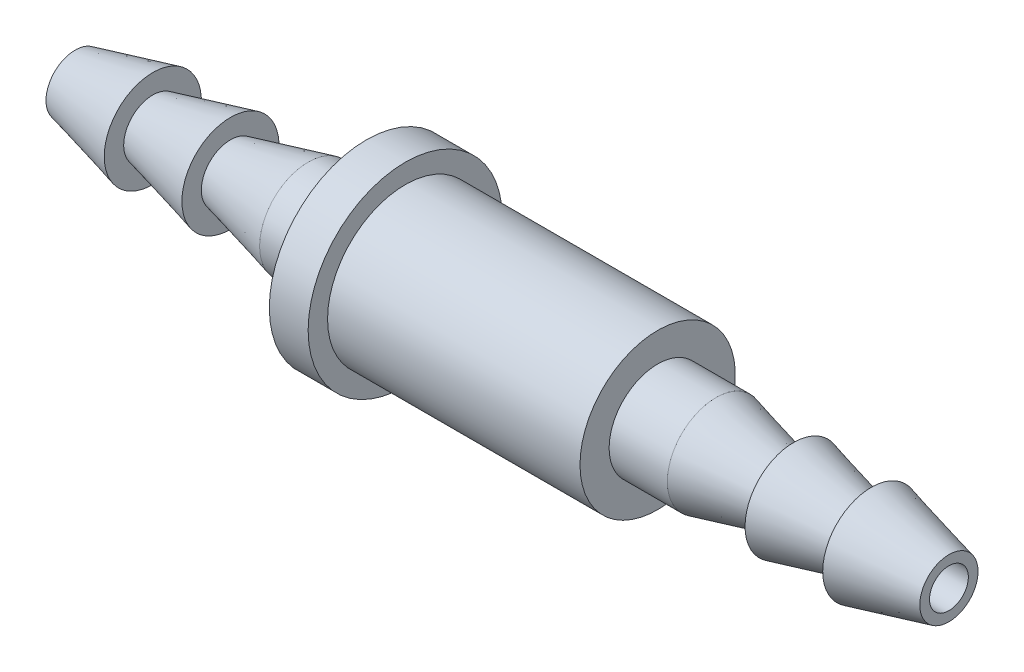
ISO-10303-21;
HEADER;
FILE_DESCRIPTION(('STEP AP214'),'2;1');
FILE_NAME('part.step','',(''),(''),'','','');
FILE_SCHEMA(('AUTOMOTIVE_DESIGN { 1 0 10303 214 1 1 1 1 }'));
ENDSEC;
DATA;
#1=APPLICATION_CONTEXT('core data for automotive mechanical design processes');
#2=APPLICATION_PROTOCOL_DEFINITION('international standard','automotive_design',2000,#1);
#3=PRODUCT_CONTEXT('',#1,'mechanical');
#4=PRODUCT('Part','Part','',(#3));
#5=PRODUCT_RELATED_PRODUCT_CATEGORY('part','',(#4));
#6=PRODUCT_DEFINITION_FORMATION('','',#4);
#7=PRODUCT_DEFINITION_CONTEXT('part definition',#1,'design');
#8=PRODUCT_DEFINITION('design','',#6,#7);
#9=PRODUCT_DEFINITION_SHAPE('','',#8);
#10=(LENGTH_UNIT() NAMED_UNIT(*) SI_UNIT(.MILLI.,.METRE.));
#11=(NAMED_UNIT(*) PLANE_ANGLE_UNIT() SI_UNIT($,.RADIAN.));
#12=(NAMED_UNIT(*) SI_UNIT($,.STERADIAN.) SOLID_ANGLE_UNIT());
#13=UNCERTAINTY_MEASURE_WITH_UNIT(LENGTH_MEASURE(1.E-05),#10,'distance_accuracy_value','');
#14=(GEOMETRIC_REPRESENTATION_CONTEXT(3) GLOBAL_UNCERTAINTY_ASSIGNED_CONTEXT((#13)) GLOBAL_UNIT_ASSIGNED_CONTEXT((#10,
#11,#12)) REPRESENTATION_CONTEXT('',''));
#15=CARTESIAN_POINT('',(0.,0.,0.));
#16=DIRECTION('',(0.,0.,1.));
#17=DIRECTION('',(1.,0.,0.));
#18=AXIS2_PLACEMENT_3D('',#15,#16,#17);
#19=CARTESIAN_POINT('',(0.,0.,0.));
#20=DIRECTION('',(-1.,0.,0.));
#21=DIRECTION('',(0.,0.,1.));
#22=AXIS2_PLACEMENT_3D('',#19,#20,#21);
#23=CONICAL_SURFACE('',#22,1.5,0.244978663126864);
#24=CARTESIAN_POINT('',(-4.,0.,0.));
#25=DIRECTION('',(-1.,0.,0.));
#26=DIRECTION('',(0.,0.,1.));
#27=AXIS2_PLACEMENT_3D('',#24,#25,#26);
#28=CIRCLE('',#27,2.5);
#29=CARTESIAN_POINT('',(-4.,0.,2.5));
#30=VERTEX_POINT('',#29);
#31=EDGE_CURVE('E10',#30,#30,#28,.T.);
#32=ORIENTED_EDGE('',*,*,#31,.F.);
#33=EDGE_LOOP('',(#32));
#34=FACE_BOUND('',#33,.T.);
#35=CARTESIAN_POINT('',(0.,0.,0.));
#36=DIRECTION('',(-1.,0.,0.));
#37=DIRECTION('',(0.,0.,1.));
#38=AXIS2_PLACEMENT_3D('',#35,#36,#37);
#39=CIRCLE('',#38,1.5);
#40=CARTESIAN_POINT('',(0.,0.,1.5));
#41=VERTEX_POINT('',#40);
#42=EDGE_CURVE('E92',#41,#41,#39,.T.);
#43=ORIENTED_EDGE('',*,*,#42,.T.);
#44=EDGE_LOOP('',(#43));
#45=FACE_BOUND('',#44,.T.);
#46=ADVANCED_FACE('F34',(#34,#45),#23,.T.);
#47=CARTESIAN_POINT('',(-4.,2.5,0.));
#48=DIRECTION('',(1.,0.,0.));
#49=DIRECTION('',(0.,0.,-1.));
#50=AXIS2_PLACEMENT_3D('',#47,#48,#49);
#51=PLANE('',#50);
#52=CARTESIAN_POINT('',(-4.,0.,0.));
#53=DIRECTION('',(-1.,0.,0.));
#54=DIRECTION('',(0.,0.,1.));
#55=AXIS2_PLACEMENT_3D('',#52,#53,#54);
#56=CIRCLE('',#55,1.5);
#57=CARTESIAN_POINT('',(-4.,0.,1.5));
#58=VERTEX_POINT('',#57);
#59=EDGE_CURVE('E40',#58,#58,#56,.T.);
#60=ORIENTED_EDGE('',*,*,#59,.F.);
#61=EDGE_LOOP('',(#60));
#62=FACE_BOUND('',#61,.T.);
#63=ORIENTED_EDGE('',*,*,#31,.T.);
#64=EDGE_LOOP('',(#63));
#65=FACE_BOUND('',#64,.T.);
#66=ADVANCED_FACE('F203',(#62,#65),#51,.F.);
#67=CARTESIAN_POINT('',(-4.,0.,0.));
#68=DIRECTION('',(-1.,0.,0.));
#69=DIRECTION('',(0.,0.,1.));
#70=AXIS2_PLACEMENT_3D('',#67,#68,#69);
#71=CONICAL_SURFACE('',#70,1.5,0.244978663126864);
#72=CARTESIAN_POINT('',(-8.00000000000001,0.,0.));
#73=DIRECTION('',(-1.,0.,0.));
#74=DIRECTION('',(0.,0.,1.));
#75=AXIS2_PLACEMENT_3D('',#72,#73,#74);
#76=CIRCLE('',#75,2.5);
#77=CARTESIAN_POINT('',(-8.00000000000001,0.,2.5));
#78=VERTEX_POINT('',#77);
#79=EDGE_CURVE('E44',#78,#78,#76,.T.);
#80=ORIENTED_EDGE('',*,*,#79,.F.);
#81=EDGE_LOOP('',(#80));
#82=FACE_BOUND('',#81,.T.);
#83=ORIENTED_EDGE('',*,*,#59,.T.);
#84=EDGE_LOOP('',(#83));
#85=FACE_BOUND('',#84,.T.);
#86=ADVANCED_FACE('F198',(#82,#85),#71,.T.);
#87=CARTESIAN_POINT('',(-8.,2.5,0.));
#88=DIRECTION('',(1.,0.,0.));
#89=DIRECTION('',(0.,0.,-1.));
#90=AXIS2_PLACEMENT_3D('',#87,#88,#89);
#91=PLANE('',#90);
#92=CARTESIAN_POINT('',(-8.00000000000001,0.,0.));
#93=DIRECTION('',(-1.,0.,0.));
#94=DIRECTION('',(0.,0.,1.));
#95=AXIS2_PLACEMENT_3D('',#92,#93,#94);
#96=CIRCLE('',#95,1.5);
#97=CARTESIAN_POINT('',(-8.00000000000001,0.,1.5));
#98=VERTEX_POINT('',#97);
#99=EDGE_CURVE('E48',#98,#98,#96,.T.);
#100=ORIENTED_EDGE('',*,*,#99,.F.);
#101=EDGE_LOOP('',(#100));
#102=FACE_BOUND('',#101,.T.);
#103=ORIENTED_EDGE('',*,*,#79,.T.);
#104=EDGE_LOOP('',(#103));
#105=FACE_BOUND('',#104,.T.);
#106=ADVANCED_FACE('F192',(#102,#105),#91,.F.);
#107=CARTESIAN_POINT('',(-8.00000000000001,0.,0.));
#108=DIRECTION('',(-1.,0.,0.));
#109=DIRECTION('',(0.,0.,1.));
#110=AXIS2_PLACEMENT_3D('',#107,#108,#109);
#111=CONICAL_SURFACE('',#110,1.5,0.244978663126864);
#112=CARTESIAN_POINT('',(-12.,0.,0.));
#113=DIRECTION('',(-1.,0.,0.));
#114=DIRECTION('',(0.,0.,1.));
#115=AXIS2_PLACEMENT_3D('',#112,#113,#114);
#116=CIRCLE('',#115,2.5);
#117=CARTESIAN_POINT('',(-12.,0.,2.5));
#118=VERTEX_POINT('',#117);
#119=EDGE_CURVE('E53',#118,#118,#116,.T.);
#120=ORIENTED_EDGE('',*,*,#119,.F.);
#121=EDGE_LOOP('',(#120));
#122=FACE_BOUND('',#121,.T.);
#123=ORIENTED_EDGE('',*,*,#99,.T.);
#124=EDGE_LOOP('',(#123));
#125=FACE_BOUND('',#124,.T.);
#126=ADVANCED_FACE('F186',(#122,#125),#111,.T.);
#127=CARTESIAN_POINT('',(-45.,0.,0.));
#128=DIRECTION('',(-1.,0.,0.));
#129=DIRECTION('',(0.,0.,1.));
#130=AXIS2_PLACEMENT_3D('',#127,#128,#129);
#131=CYLINDRICAL_SURFACE('',#130,2.5);
#132=CARTESIAN_POINT('',(-15.,0.,0.));
#133=DIRECTION('',(-1.,0.,0.));
#134=DIRECTION('',(0.,0.,1.));
#135=AXIS2_PLACEMENT_3D('',#132,#133,#134);
#136=CIRCLE('',#135,2.5);
#137=CARTESIAN_POINT('',(-15.,0.,2.5));
#138=VERTEX_POINT('',#137);
#139=EDGE_CURVE('E56',#138,#138,#136,.T.);
#140=ORIENTED_EDGE('',*,*,#139,.F.);
#141=EDGE_LOOP('',(#140));
#142=FACE_BOUND('',#141,.T.);
#143=ORIENTED_EDGE('',*,*,#119,.T.);
#144=EDGE_LOOP('',(#143));
#145=FACE_BOUND('',#144,.T.);
#146=ADVANCED_FACE('F180',(#142,#145),#131,.T.);
#147=CARTESIAN_POINT('',(-15.,4.,0.));
#148=DIRECTION('',(-1.,0.,0.));
#149=DIRECTION('',(0.,0.,1.));
#150=AXIS2_PLACEMENT_3D('',#147,#148,#149);
#151=PLANE('',#150);
#152=CARTESIAN_POINT('',(-15.,0.,0.));
#153=DIRECTION('',(-1.,0.,0.));
#154=DIRECTION('',(0.,0.,1.));
#155=AXIS2_PLACEMENT_3D('',#152,#153,#154);
#156=CIRCLE('',#155,4.);
#157=CARTESIAN_POINT('',(-15.,0.,4.));
#158=VERTEX_POINT('',#157);
#159=EDGE_CURVE('E59',#158,#158,#156,.T.);
#160=ORIENTED_EDGE('',*,*,#159,.F.);
#161=EDGE_LOOP('',(#160));
#162=FACE_BOUND('',#161,.T.);
#163=ORIENTED_EDGE('',*,*,#139,.T.);
#164=EDGE_LOOP('',(#163));
#165=FACE_BOUND('',#164,.T.);
#166=ADVANCED_FACE('F174',(#162,#165),#151,.F.);
#167=CARTESIAN_POINT('',(-45.,0.,0.));
#168=DIRECTION('',(-1.,0.,0.));
#169=DIRECTION('',(0.,0.,1.));
#170=AXIS2_PLACEMENT_3D('',#167,#168,#169);
#171=CYLINDRICAL_SURFACE('',#170,4.);
#172=CARTESIAN_POINT('',(-28.,0.,0.));
#173=DIRECTION('',(-1.,0.,0.));
#174=DIRECTION('',(0.,0.,1.));
#175=AXIS2_PLACEMENT_3D('',#172,#173,#174);
#176=CIRCLE('',#175,4.);
#177=CARTESIAN_POINT('',(-28.,0.,4.));
#178=VERTEX_POINT('',#177);
#179=EDGE_CURVE('E62',#178,#178,#176,.T.);
#180=ORIENTED_EDGE('',*,*,#179,.F.);
#181=EDGE_LOOP('',(#180));
#182=FACE_BOUND('',#181,.T.);
#183=ORIENTED_EDGE('',*,*,#159,.T.);
#184=EDGE_LOOP('',(#183));
#185=FACE_BOUND('',#184,.T.);
#186=ADVANCED_FACE('F168',(#182,#185),#171,.T.);
#187=CARTESIAN_POINT('',(-28.,5.,0.));
#188=DIRECTION('',(-1.,0.,0.));
#189=DIRECTION('',(0.,0.,1.));
#190=AXIS2_PLACEMENT_3D('',#187,#188,#189);
#191=PLANE('',#190);
#192=CARTESIAN_POINT('',(-28.,0.,0.));
#193=DIRECTION('',(-1.,0.,0.));
#194=DIRECTION('',(0.,0.,1.));
#195=AXIS2_PLACEMENT_3D('',#192,#193,#194);
#196=CIRCLE('',#195,5.);
#197=CARTESIAN_POINT('',(-28.,0.,5.));
#198=VERTEX_POINT('',#197);
#199=EDGE_CURVE('E65',#198,#198,#196,.T.);
#200=ORIENTED_EDGE('',*,*,#199,.F.);
#201=EDGE_LOOP('',(#200));
#202=FACE_BOUND('',#201,.T.);
#203=ORIENTED_EDGE('',*,*,#179,.T.);
#204=EDGE_LOOP('',(#203));
#205=FACE_BOUND('',#204,.T.);
#206=ADVANCED_FACE('F162',(#202,#205),#191,.F.);
#207=CARTESIAN_POINT('',(-45.,0.,0.));
#208=DIRECTION('',(-1.,0.,0.));
#209=DIRECTION('',(0.,0.,1.));
#210=AXIS2_PLACEMENT_3D('',#207,#208,#209);
#211=CYLINDRICAL_SURFACE('',#210,5.);
#212=CARTESIAN_POINT('',(-30.,0.,0.));
#213=DIRECTION('',(-1.,0.,0.));
#214=DIRECTION('',(0.,0.,1.));
#215=AXIS2_PLACEMENT_3D('',#212,#213,#214);
#216=CIRCLE('',#215,5.);
#217=CARTESIAN_POINT('',(-30.,0.,5.));
#218=VERTEX_POINT('',#217);
#219=EDGE_CURVE('E68',#218,#218,#216,.T.);
#220=ORIENTED_EDGE('',*,*,#219,.F.);
#221=EDGE_LOOP('',(#220));
#222=FACE_BOUND('',#221,.T.);
#223=ORIENTED_EDGE('',*,*,#199,.T.);
#224=EDGE_LOOP('',(#223));
#225=FACE_BOUND('',#224,.T.);
#226=ADVANCED_FACE('F156',(#222,#225),#211,.T.);
#227=CARTESIAN_POINT('',(-30.,2.5,0.));
#228=DIRECTION('',(1.,0.,0.));
#229=DIRECTION('',(0.,0.,-1.));
#230=AXIS2_PLACEMENT_3D('',#227,#228,#229);
#231=PLANE('',#230);
#232=CARTESIAN_POINT('',(-30.,0.,0.));
#233=DIRECTION('',(-1.,0.,0.));
#234=DIRECTION('',(0.,0.,1.));
#235=AXIS2_PLACEMENT_3D('',#232,#233,#234);
#236=CIRCLE('',#235,2.5);
#237=CARTESIAN_POINT('',(-30.,0.,2.5));
#238=VERTEX_POINT('',#237);
#239=EDGE_CURVE('E71',#238,#238,#236,.T.);
#240=ORIENTED_EDGE('',*,*,#239,.F.);
#241=EDGE_LOOP('',(#240));
#242=FACE_BOUND('',#241,.T.);
#243=ORIENTED_EDGE('',*,*,#219,.T.);
#244=EDGE_LOOP('',(#243));
#245=FACE_BOUND('',#244,.T.);
#246=ADVANCED_FACE('F150',(#242,#245),#231,.F.);
#247=CARTESIAN_POINT('',(-45.,0.,0.));
#248=DIRECTION('',(-1.,0.,0.));
#249=DIRECTION('',(0.,0.,1.));
#250=AXIS2_PLACEMENT_3D('',#247,#248,#249);
#251=CYLINDRICAL_SURFACE('',#250,2.5);
#252=CARTESIAN_POINT('',(-33.,0.,0.));
#253=DIRECTION('',(-1.,0.,0.));
#254=DIRECTION('',(0.,0.,1.));
#255=AXIS2_PLACEMENT_3D('',#252,#253,#254);
#256=CIRCLE('',#255,2.5);
#257=CARTESIAN_POINT('',(-33.,0.,2.5));
#258=VERTEX_POINT('',#257);
#259=EDGE_CURVE('E74',#258,#258,#256,.T.);
#260=ORIENTED_EDGE('',*,*,#259,.F.);
#261=EDGE_LOOP('',(#260));
#262=FACE_BOUND('',#261,.T.);
#263=ORIENTED_EDGE('',*,*,#239,.T.);
#264=EDGE_LOOP('',(#263));
#265=FACE_BOUND('',#264,.T.);
#266=ADVANCED_FACE('F144',(#262,#265),#251,.T.);
#267=CARTESIAN_POINT('',(-33.,0.,0.));
#268=DIRECTION('',(1.,0.,0.));
#269=DIRECTION('',(0.,0.,-1.));
#270=AXIS2_PLACEMENT_3D('',#267,#268,#269);
#271=CONICAL_SURFACE('',#270,2.5,0.244978663126864);
#272=CARTESIAN_POINT('',(-37.,0.,0.));
#273=DIRECTION('',(-1.,0.,0.));
#274=DIRECTION('',(0.,0.,1.));
#275=AXIS2_PLACEMENT_3D('',#272,#273,#274);
#276=CIRCLE('',#275,1.5);
#277=CARTESIAN_POINT('',(-37.,0.,1.5));
#278=VERTEX_POINT('',#277);
#279=EDGE_CURVE('E77',#278,#278,#276,.T.);
#280=ORIENTED_EDGE('',*,*,#279,.F.);
#281=EDGE_LOOP('',(#280));
#282=FACE_BOUND('',#281,.T.);
#283=ORIENTED_EDGE('',*,*,#259,.T.);
#284=EDGE_LOOP('',(#283));
#285=FACE_BOUND('',#284,.T.);
#286=ADVANCED_FACE('F138',(#282,#285),#271,.T.);
#287=CARTESIAN_POINT('',(-37.,2.5,0.));
#288=DIRECTION('',(-1.,0.,0.));
#289=DIRECTION('',(0.,0.,1.));
#290=AXIS2_PLACEMENT_3D('',#287,#288,#289);
#291=PLANE('',#290);
#292=CARTESIAN_POINT('',(-37.,0.,0.));
#293=DIRECTION('',(-1.,0.,0.));
#294=DIRECTION('',(0.,0.,1.));
#295=AXIS2_PLACEMENT_3D('',#292,#293,#294);
#296=CIRCLE('',#295,2.5);
#297=CARTESIAN_POINT('',(-37.,0.,2.5));
#298=VERTEX_POINT('',#297);
#299=EDGE_CURVE('E80',#298,#298,#296,.T.);
#300=ORIENTED_EDGE('',*,*,#299,.F.);
#301=EDGE_LOOP('',(#300));
#302=FACE_BOUND('',#301,.T.);
#303=ORIENTED_EDGE('',*,*,#279,.T.);
#304=EDGE_LOOP('',(#303));
#305=FACE_BOUND('',#304,.T.);
#306=ADVANCED_FACE('F132',(#302,#305),#291,.F.);
#307=CARTESIAN_POINT('',(-37.,0.,0.));
#308=DIRECTION('',(1.,0.,0.));
#309=DIRECTION('',(0.,0.,-1.));
#310=AXIS2_PLACEMENT_3D('',#307,#308,#309);
#311=CONICAL_SURFACE('',#310,2.5,0.244978663126864);
#312=CARTESIAN_POINT('',(-41.,0.,0.));
#313=DIRECTION('',(-1.,0.,0.));
#314=DIRECTION('',(0.,0.,1.));
#315=AXIS2_PLACEMENT_3D('',#312,#313,#314);
#316=CIRCLE('',#315,1.5);
#317=CARTESIAN_POINT('',(-41.,0.,1.5));
#318=VERTEX_POINT('',#317);
#319=EDGE_CURVE('E83',#318,#318,#316,.T.);
#320=ORIENTED_EDGE('',*,*,#319,.F.);
#321=EDGE_LOOP('',(#320));
#322=FACE_BOUND('',#321,.T.);
#323=ORIENTED_EDGE('',*,*,#299,.T.);
#324=EDGE_LOOP('',(#323));
#325=FACE_BOUND('',#324,.T.);
#326=ADVANCED_FACE('F126',(#322,#325),#311,.T.);
#327=CARTESIAN_POINT('',(-41.,2.5,0.));
#328=DIRECTION('',(-1.,0.,0.));
#329=DIRECTION('',(0.,0.,1.));
#330=AXIS2_PLACEMENT_3D('',#327,#328,#329);
#331=PLANE('',#330);
#332=CARTESIAN_POINT('',(-41.,0.,0.));
#333=DIRECTION('',(-1.,0.,0.));
#334=DIRECTION('',(0.,0.,1.));
#335=AXIS2_PLACEMENT_3D('',#332,#333,#334);
#336=CIRCLE('',#335,2.5);
#337=CARTESIAN_POINT('',(-41.,0.,2.5));
#338=VERTEX_POINT('',#337);
#339=EDGE_CURVE('E86',#338,#338,#336,.T.);
#340=ORIENTED_EDGE('',*,*,#339,.F.);
#341=EDGE_LOOP('',(#340));
#342=FACE_BOUND('',#341,.T.);
#343=ORIENTED_EDGE('',*,*,#319,.T.);
#344=EDGE_LOOP('',(#343));
#345=FACE_BOUND('',#344,.T.);
#346=ADVANCED_FACE('F120',(#342,#345),#331,.F.);
#347=CARTESIAN_POINT('',(-41.,0.,0.));
#348=DIRECTION('',(1.,0.,0.));
#349=DIRECTION('',(0.,0.,-1.));
#350=AXIS2_PLACEMENT_3D('',#347,#348,#349);
#351=CONICAL_SURFACE('',#350,2.5,0.244978663126864);
#352=CARTESIAN_POINT('',(-45.,0.,0.));
#353=DIRECTION('',(-1.,0.,0.));
#354=DIRECTION('',(0.,0.,1.));
#355=AXIS2_PLACEMENT_3D('',#352,#353,#354);
#356=CIRCLE('',#355,1.5);
#357=CARTESIAN_POINT('',(-45.,0.,1.5));
#358=VERTEX_POINT('',#357);
#359=EDGE_CURVE('E89',#358,#358,#356,.T.);
#360=ORIENTED_EDGE('',*,*,#359,.F.);
#361=EDGE_LOOP('',(#360));
#362=FACE_BOUND('',#361,.T.);
#363=ORIENTED_EDGE('',*,*,#339,.T.);
#364=EDGE_LOOP('',(#363));
#365=FACE_BOUND('',#364,.T.);
#366=ADVANCED_FACE('F114',(#362,#365),#351,.T.);
#367=CARTESIAN_POINT('',(-45.,1.5,0.));
#368=DIRECTION('',(1.,0.,0.));
#369=DIRECTION('',(0.,0.,-1.));
#370=AXIS2_PLACEMENT_3D('',#367,#368,#369);
#371=PLANE('',#370);
#372=CARTESIAN_POINT('',(-45.,0.,0.));
#373=DIRECTION('',(-1.,0.,0.));
#374=DIRECTION('',(0.,0.,1.));
#375=AXIS2_PLACEMENT_3D('',#372,#373,#374);
#376=CIRCLE('',#375,1.);
#377=CARTESIAN_POINT('',(-45.,0.,1.));
#378=VERTEX_POINT('',#377);
#379=EDGE_CURVE('E96',#378,#378,#376,.T.);
#380=ORIENTED_EDGE('',*,*,#379,.F.);
#381=EDGE_LOOP('',(#380));
#382=FACE_BOUND('',#381,.T.);
#383=ORIENTED_EDGE('',*,*,#359,.T.);
#384=EDGE_LOOP('',(#383));
#385=FACE_BOUND('',#384,.T.);
#386=ADVANCED_FACE('F111',(#382,#385),#371,.F.);
#387=CARTESIAN_POINT('',(0.,1.5,0.));
#388=DIRECTION('',(-1.,0.,0.));
#389=DIRECTION('',(0.,0.,1.));
#390=AXIS2_PLACEMENT_3D('',#387,#388,#389);
#391=PLANE('',#390);
#392=CARTESIAN_POINT('',(0.,0.,0.));
#393=DIRECTION('',(-1.,0.,0.));
#394=DIRECTION('',(0.,0.,1.));
#395=AXIS2_PLACEMENT_3D('',#392,#393,#394);
#396=CIRCLE('',#395,1.);
#397=CARTESIAN_POINT('',(0.,0.,1.));
#398=VERTEX_POINT('',#397);
#399=EDGE_CURVE('E95',#398,#398,#396,.T.);
#400=ORIENTED_EDGE('',*,*,#399,.T.);
#401=EDGE_LOOP('',(#400));
#402=FACE_BOUND('',#401,.T.);
#403=ORIENTED_EDGE('',*,*,#42,.F.);
#404=EDGE_LOOP('',(#403));
#405=FACE_BOUND('',#404,.T.);
#406=ADVANCED_FACE('F102',(#402,#405),#391,.F.);
#407=CARTESIAN_POINT('',(0.,0.,0.));
#408=DIRECTION('',(-1.,0.,0.));
#409=DIRECTION('',(0.,0.,1.));
#410=AXIS2_PLACEMENT_3D('',#407,#408,#409);
#411=CYLINDRICAL_SURFACE('',#410,1.);
#412=ORIENTED_EDGE('',*,*,#399,.F.);
#413=EDGE_LOOP('',(#412));
#414=FACE_BOUND('',#413,.T.);
#415=ORIENTED_EDGE('',*,*,#379,.T.);
#416=EDGE_LOOP('',(#415));
#417=FACE_BOUND('',#416,.T.);
#418=ADVANCED_FACE('F105',(#414,#417),#411,.F.);
#419=CLOSED_SHELL('',(#46,#66,#86,#106,#126,#146,#166,#186,#206,#226,#246,#266,#286,#306,#326,
#346,#366,#386,#406,#418));
#420=MANIFOLD_SOLID_BREP('B2',#419);
#421=ADVANCED_BREP_SHAPE_REPRESENTATION('',(#18,#420),#14);
#422=SHAPE_DEFINITION_REPRESENTATION(#9,#421);
ENDSEC;
END-ISO-10303-21;
